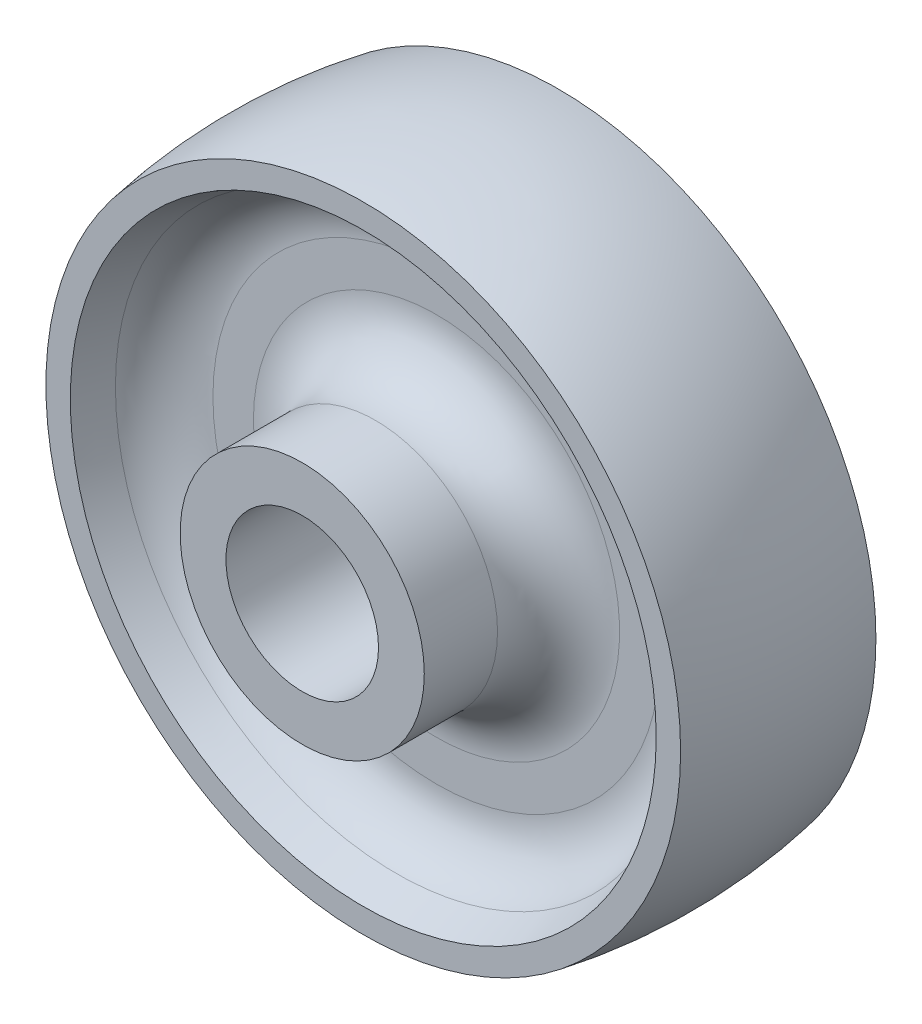
ISO-10303-21;
HEADER;
FILE_DESCRIPTION(('STEP AP214'),'2;1');
FILE_NAME('part.step','',(''),(''),'','','');
FILE_SCHEMA(('AUTOMOTIVE_DESIGN { 1 0 10303 214 1 1 1 1 }'));
ENDSEC;
DATA;
#1=APPLICATION_CONTEXT('core data for automotive mechanical design processes');
#2=APPLICATION_PROTOCOL_DEFINITION('international standard','automotive_design',2000,#1);
#3=PRODUCT_CONTEXT('',#1,'mechanical');
#4=PRODUCT('Part','Part','',(#3));
#5=PRODUCT_RELATED_PRODUCT_CATEGORY('part','',(#4));
#6=PRODUCT_DEFINITION_FORMATION('','',#4);
#7=PRODUCT_DEFINITION_CONTEXT('part definition',#1,'design');
#8=PRODUCT_DEFINITION('design','',#6,#7);
#9=PRODUCT_DEFINITION_SHAPE('','',#8);
#10=(LENGTH_UNIT() NAMED_UNIT(*) SI_UNIT(.MILLI.,.METRE.));
#11=(NAMED_UNIT(*) PLANE_ANGLE_UNIT() SI_UNIT($,.RADIAN.));
#12=(NAMED_UNIT(*) SI_UNIT($,.STERADIAN.) SOLID_ANGLE_UNIT());
#13=UNCERTAINTY_MEASURE_WITH_UNIT(LENGTH_MEASURE(1.E-05),#10,'distance_accuracy_value','');
#14=(GEOMETRIC_REPRESENTATION_CONTEXT(3) GLOBAL_UNCERTAINTY_ASSIGNED_CONTEXT((#13)) GLOBAL_UNIT_ASSIGNED_CONTEXT((#10,
#11,#12)) REPRESENTATION_CONTEXT('',''));
#15=CARTESIAN_POINT('',(0.,0.,0.));
#16=DIRECTION('',(0.,0.,1.));
#17=DIRECTION('',(1.,0.,0.));
#18=AXIS2_PLACEMENT_3D('',#15,#16,#17);
#19=CARTESIAN_POINT('',(0.,20.,-26.));
#20=DIRECTION('',(0.,0.,1.));
#21=DIRECTION('',(1.,0.,0.));
#22=AXIS2_PLACEMENT_3D('',#19,#20,#21);
#23=PLANE('',#22);
#24=CARTESIAN_POINT('',(0.,0.,-26.));
#25=DIRECTION('',(0.,0.,1.));
#26=DIRECTION('',(1.,0.,0.));
#27=AXIS2_PLACEMENT_3D('',#24,#25,#26);
#28=CIRCLE('',#27,20.);
#29=CARTESIAN_POINT('',(20.,0.,-26.));
#30=VERTEX_POINT('',#29);
#31=EDGE_CURVE('E108',#30,#30,#28,.T.);
#32=ORIENTED_EDGE('',*,*,#31,.F.);
#33=EDGE_LOOP('',(#32));
#34=FACE_BOUND('',#33,.T.);
#35=CARTESIAN_POINT('',(0.,0.,-26.));
#36=DIRECTION('',(0.,0.,1.));
#37=DIRECTION('',(1.,0.,0.));
#38=AXIS2_PLACEMENT_3D('',#35,#36,#37);
#39=CIRCLE('',#38,12.5);
#40=CARTESIAN_POINT('',(12.5,0.,-26.));
#41=VERTEX_POINT('',#40);
#42=EDGE_CURVE('E80',#41,#41,#39,.T.);
#43=ORIENTED_EDGE('',*,*,#42,.T.);
#44=EDGE_LOOP('',(#43));
#45=FACE_BOUND('',#44,.T.);
#46=ADVANCED_FACE('F40',(#34,#45),#23,.F.);
#47=CARTESIAN_POINT('',(0.,0.,0.));
#48=DIRECTION('',(0.,0.,1.));
#49=DIRECTION('',(1.,0.,0.));
#50=AXIS2_PLACEMENT_3D('',#47,#48,#49);
#51=CYLINDRICAL_SURFACE('',#50,12.5);
#52=ORIENTED_EDGE('',*,*,#42,.F.);
#53=EDGE_LOOP('',(#52));
#54=FACE_BOUND('',#53,.T.);
#55=CARTESIAN_POINT('',(0.,0.,26.));
#56=DIRECTION('',(0.,0.,1.));
#57=DIRECTION('',(1.,0.,0.));
#58=AXIS2_PLACEMENT_3D('',#55,#56,#57);
#59=CIRCLE('',#58,12.5);
#60=CARTESIAN_POINT('',(12.5,0.,26.));
#61=VERTEX_POINT('',#60);
#62=EDGE_CURVE('E84',#61,#61,#59,.T.);
#63=ORIENTED_EDGE('',*,*,#62,.T.);
#64=EDGE_LOOP('',(#63));
#65=FACE_BOUND('',#64,.T.);
#66=ADVANCED_FACE('F117',(#54,#65),#51,.F.);
#67=CARTESIAN_POINT('',(0.,12.5,26.));
#68=DIRECTION('',(0.,0.,-1.));
#69=DIRECTION('',(-1.,0.,0.));
#70=AXIS2_PLACEMENT_3D('',#67,#68,#69);
#71=PLANE('',#70);
#72=ORIENTED_EDGE('',*,*,#62,.F.);
#73=EDGE_LOOP('',(#72));
#74=FACE_BOUND('',#73,.T.);
#75=CARTESIAN_POINT('',(0.,0.,26.));
#76=DIRECTION('',(0.,0.,1.));
#77=DIRECTION('',(1.,0.,0.));
#78=AXIS2_PLACEMENT_3D('',#75,#76,#77);
#79=CIRCLE('',#78,20.);
#80=CARTESIAN_POINT('',(20.,0.,26.));
#81=VERTEX_POINT('',#80);
#82=EDGE_CURVE('E88',#81,#81,#79,.T.);
#83=ORIENTED_EDGE('',*,*,#82,.T.);
#84=EDGE_LOOP('',(#83));
#85=FACE_BOUND('',#84,.T.);
#86=ADVANCED_FACE('F123',(#74,#85),#71,.F.);
#87=CARTESIAN_POINT('',(0.,0.,0.));
#88=DIRECTION('',(0.,0.,1.));
#89=DIRECTION('',(1.,0.,0.));
#90=AXIS2_PLACEMENT_3D('',#87,#88,#89);
#91=CYLINDRICAL_SURFACE('',#90,20.);
#92=CARTESIAN_POINT('',(0.,0.,14.));
#93=DIRECTION('',(0.,0.,-1.));
#94=DIRECTION('',(-1.,0.,0.));
#95=AXIS2_PLACEMENT_3D('',#92,#93,#94);
#96=CIRCLE('',#95,20.);
#97=CARTESIAN_POINT('',(-20.,0.,14.));
#98=VERTEX_POINT('',#97);
#99=EDGE_CURVE('E10',#98,#98,#96,.F.);
#100=ORIENTED_EDGE('',*,*,#99,.T.);
#101=EDGE_LOOP('',(#100));
#102=FACE_BOUND('',#101,.T.);
#103=ORIENTED_EDGE('',*,*,#82,.F.);
#104=EDGE_LOOP('',(#103));
#105=FACE_BOUND('',#104,.T.);
#106=ADVANCED_FACE('F129',(#102,#105),#91,.T.);
#107=CARTESIAN_POINT('',(0.,20.,4.));
#108=DIRECTION('',(0.,0.,-1.));
#109=DIRECTION('',(-1.,0.,0.));
#110=AXIS2_PLACEMENT_3D('',#107,#108,#109);
#111=PLANE('',#110);
#112=CARTESIAN_POINT('',(0.,0.,4.));
#113=DIRECTION('',(0.,0.,-1.));
#114=DIRECTION('',(-1.,0.,0.));
#115=AXIS2_PLACEMENT_3D('',#112,#113,#114);
#116=CIRCLE('',#115,36.6302818067085);
#117=CARTESIAN_POINT('',(-36.6302818067085,0.,4.));
#118=VERTEX_POINT('',#117);
#119=EDGE_CURVE('E53',#118,#118,#116,.F.);
#120=ORIENTED_EDGE('',*,*,#119,.T.);
#121=EDGE_LOOP('',(#120));
#122=FACE_BOUND('',#121,.T.);
#123=CARTESIAN_POINT('',(0.,0.,4.));
#124=DIRECTION('',(0.,0.,-1.));
#125=DIRECTION('',(-1.,0.,0.));
#126=AXIS2_PLACEMENT_3D('',#123,#124,#125);
#127=CIRCLE('',#126,30.);
#128=CARTESIAN_POINT('',(-30.,0.,4.));
#129=VERTEX_POINT('',#128);
#130=EDGE_CURVE('E58',#129,#129,#127,.T.);
#131=ORIENTED_EDGE('',*,*,#130,.T.);
#132=EDGE_LOOP('',(#131));
#133=FACE_BOUND('',#132,.T.);
#134=ADVANCED_FACE('F134',(#122,#133),#111,.F.);
#135=CARTESIAN_POINT('',(0.,0.,16.));
#136=DIRECTION('',(0.,0.,1.));
#137=DIRECTION('',(1.,0.,0.));
#138=AXIS2_PLACEMENT_3D('',#135,#136,#137);
#139=CONICAL_SURFACE('',#138,48.,0.349065850398861);
#140=CARTESIAN_POINT('',(0.,0.,10.5797985667434));
#141=DIRECTION('',(0.,0.,1.));
#142=DIRECTION('',(1.,0.,0.));
#143=AXIS2_PLACEMENT_3D('',#140,#141,#142);
#144=CIRCLE('',#143,46.0272080145676);
#145=CARTESIAN_POINT('',(46.0272080145676,0.,10.5797985667434));
#146=VERTEX_POINT('',#145);
#147=EDGE_CURVE('E48',#146,#146,#144,.F.);
#148=ORIENTED_EDGE('',*,*,#147,.T.);
#149=EDGE_LOOP('',(#148));
#150=FACE_BOUND('',#149,.T.);
#151=CARTESIAN_POINT('',(0.,0.,16.));
#152=DIRECTION('',(0.,0.,1.));
#153=DIRECTION('',(1.,0.,0.));
#154=AXIS2_PLACEMENT_3D('',#151,#152,#153);
#155=CIRCLE('',#154,48.);
#156=CARTESIAN_POINT('',(48.,0.,16.));
#157=VERTEX_POINT('',#156);
#158=EDGE_CURVE('E92',#157,#157,#155,.T.);
#159=ORIENTED_EDGE('',*,*,#158,.T.);
#160=EDGE_LOOP('',(#159));
#161=FACE_BOUND('',#160,.T.);
#162=ADVANCED_FACE('F140',(#150,#161),#139,.F.);
#163=CARTESIAN_POINT('',(0.,48.,16.));
#164=DIRECTION('',(0.,0.,-1.));
#165=DIRECTION('',(-1.,0.,0.));
#166=AXIS2_PLACEMENT_3D('',#163,#164,#165);
#167=PLANE('',#166);
#168=ORIENTED_EDGE('',*,*,#158,.F.);
#169=EDGE_LOOP('',(#168));
#170=FACE_BOUND('',#169,.T.);
#171=CARTESIAN_POINT('',(0.,0.,16.));
#172=DIRECTION('',(0.,0.,1.));
#173=DIRECTION('',(1.,0.,0.));
#174=AXIS2_PLACEMENT_3D('',#171,#172,#173);
#175=CIRCLE('',#174,52.);
#176=CARTESIAN_POINT('',(52.,0.,16.));
#177=VERTEX_POINT('',#176);
#178=EDGE_CURVE('E96',#177,#177,#175,.T.);
#179=ORIENTED_EDGE('',*,*,#178,.T.);
#180=EDGE_LOOP('',(#179));
#181=FACE_BOUND('',#180,.T.);
#182=ADVANCED_FACE('F180',(#170,#181),#167,.F.);
#183=CARTESIAN_POINT('',(0.,0.,0.));
#184=DIRECTION('',(0.,0.,1.));
#185=DIRECTION('',(1.,0.,0.));
#186=AXIS2_PLACEMENT_3D('',#183,#184,#185);
#187=DEGENERATE_TOROIDAL_SURFACE('',#186,36.5663593019381,90.,.F.);
#188=ORIENTED_EDGE('',*,*,#178,.F.);
#189=EDGE_LOOP('',(#188));
#190=FACE_BOUND('',#189,.T.);
#191=CARTESIAN_POINT('',(0.,0.,-16.));
#192=DIRECTION('',(0.,0.,1.));
#193=DIRECTION('',(1.,0.,0.));
#194=AXIS2_PLACEMENT_3D('',#191,#192,#193);
#195=CIRCLE('',#194,52.);
#196=CARTESIAN_POINT('',(52.,0.,-16.));
#197=VERTEX_POINT('',#196);
#198=EDGE_CURVE('E100',#197,#197,#195,.T.);
#199=ORIENTED_EDGE('',*,*,#198,.T.);
#200=EDGE_LOOP('',(#199));
#201=FACE_BOUND('',#200,.T.);
#202=ADVANCED_FACE('F231',(#190,#201),#187,.F.);
#203=CARTESIAN_POINT('',(0.,52.,-16.));
#204=DIRECTION('',(0.,0.,1.));
#205=DIRECTION('',(1.,0.,0.));
#206=AXIS2_PLACEMENT_3D('',#203,#204,#205);
#207=PLANE('',#206);
#208=ORIENTED_EDGE('',*,*,#198,.F.);
#209=EDGE_LOOP('',(#208));
#210=FACE_BOUND('',#209,.T.);
#211=CARTESIAN_POINT('',(0.,0.,-16.));
#212=DIRECTION('',(0.,0.,1.));
#213=DIRECTION('',(1.,0.,0.));
#214=AXIS2_PLACEMENT_3D('',#211,#212,#213);
#215=CIRCLE('',#214,48.);
#216=CARTESIAN_POINT('',(48.,0.,-16.));
#217=VERTEX_POINT('',#216);
#218=EDGE_CURVE('E104',#217,#217,#215,.T.);
#219=ORIENTED_EDGE('',*,*,#218,.T.);
#220=EDGE_LOOP('',(#219));
#221=FACE_BOUND('',#220,.T.);
#222=ADVANCED_FACE('F240',(#210,#221),#207,.F.);
#223=CARTESIAN_POINT('',(0.,0.,-4.));
#224=DIRECTION('',(0.,0.,-1.));
#225=DIRECTION('',(-1.,0.,0.));
#226=AXIS2_PLACEMENT_3D('',#223,#224,#225);
#227=CONICAL_SURFACE('',#226,43.6323571888057,0.34906585039886);
#228=CARTESIAN_POINT('',(0.,0.,-10.5797985667434));
#229=DIRECTION('',(0.,0.,-1.));
#230=DIRECTION('',(-1.,0.,0.));
#231=AXIS2_PLACEMENT_3D('',#228,#229,#230);
#232=CIRCLE('',#231,46.0272080145676);
#233=CARTESIAN_POINT('',(-46.0272080145676,0.,-10.5797985667434));
#234=VERTEX_POINT('',#233);
#235=EDGE_CURVE('E76',#234,#234,#232,.F.);
#236=ORIENTED_EDGE('',*,*,#235,.T.);
#237=EDGE_LOOP('',(#236));
#238=FACE_BOUND('',#237,.T.);
#239=ORIENTED_EDGE('',*,*,#218,.F.);
#240=EDGE_LOOP('',(#239));
#241=FACE_BOUND('',#240,.T.);
#242=ADVANCED_FACE('F250',(#238,#241),#227,.F.);
#243=CARTESIAN_POINT('',(0.,43.6323571888057,-4.));
#244=DIRECTION('',(0.,0.,1.));
#245=DIRECTION('',(1.,0.,0.));
#246=AXIS2_PLACEMENT_3D('',#243,#244,#245);
#247=PLANE('',#246);
#248=CARTESIAN_POINT('',(0.,0.,-4.));
#249=DIRECTION('',(0.,0.,1.));
#250=DIRECTION('',(1.,0.,0.));
#251=AXIS2_PLACEMENT_3D('',#248,#249,#250);
#252=CIRCLE('',#251,36.6302818067085);
#253=CARTESIAN_POINT('',(36.6302818067085,0.,-4.));
#254=VERTEX_POINT('',#253);
#255=EDGE_CURVE('E68',#254,#254,#252,.F.);
#256=ORIENTED_EDGE('',*,*,#255,.T.);
#257=EDGE_LOOP('',(#256));
#258=FACE_BOUND('',#257,.T.);
#259=CARTESIAN_POINT('',(0.,0.,-4.));
#260=DIRECTION('',(0.,0.,1.));
#261=DIRECTION('',(1.,0.,0.));
#262=AXIS2_PLACEMENT_3D('',#259,#260,#261);
#263=CIRCLE('',#262,30.);
#264=CARTESIAN_POINT('',(30.,0.,-4.));
#265=VERTEX_POINT('',#264);
#266=EDGE_CURVE('E72',#265,#265,#263,.T.);
#267=ORIENTED_EDGE('',*,*,#266,.T.);
#268=EDGE_LOOP('',(#267));
#269=FACE_BOUND('',#268,.T.);
#270=ADVANCED_FACE('F260',(#258,#269),#247,.F.);
#271=CARTESIAN_POINT('',(0.,0.,0.));
#272=DIRECTION('',(0.,0.,1.));
#273=DIRECTION('',(1.,0.,0.));
#274=AXIS2_PLACEMENT_3D('',#271,#272,#273);
#275=CYLINDRICAL_SURFACE('',#274,20.);
#276=CARTESIAN_POINT('',(0.,0.,-14.));
#277=DIRECTION('',(0.,0.,1.));
#278=DIRECTION('',(1.,0.,0.));
#279=AXIS2_PLACEMENT_3D('',#276,#277,#278);
#280=CIRCLE('',#279,20.);
#281=CARTESIAN_POINT('',(20.,0.,-14.));
#282=VERTEX_POINT('',#281);
#283=EDGE_CURVE('E64',#282,#282,#280,.F.);
#284=ORIENTED_EDGE('',*,*,#283,.T.);
#285=EDGE_LOOP('',(#284));
#286=FACE_BOUND('',#285,.T.);
#287=ORIENTED_EDGE('',*,*,#31,.T.);
#288=EDGE_LOOP('',(#287));
#289=FACE_BOUND('',#288,.T.);
#290=ADVANCED_FACE('F113',(#286,#289),#275,.T.);
#291=CARTESIAN_POINT('',(0.,0.,-14.));
#292=DIRECTION('',(0.,0.,1.));
#293=DIRECTION('',(1.,0.,0.));
#294=AXIS2_PLACEMENT_3D('',#291,#292,#293);
#295=TOROIDAL_SURFACE('',#294,36.6302818067085,10.);
#296=ORIENTED_EDGE('',*,*,#255,.F.);
#297=EDGE_LOOP('',(#296));
#298=FACE_BOUND('',#297,.T.);
#299=ORIENTED_EDGE('',*,*,#235,.F.);
#300=EDGE_LOOP('',(#299));
#301=FACE_BOUND('',#300,.T.);
#302=ADVANCED_FACE('F145',(#298,#301),#295,.F.);
#303=CARTESIAN_POINT('',(0.,0.,-14.));
#304=DIRECTION('',(0.,0.,1.));
#305=DIRECTION('',(1.,0.,0.));
#306=AXIS2_PLACEMENT_3D('',#303,#304,#305);
#307=TOROIDAL_SURFACE('',#306,30.,10.);
#308=ORIENTED_EDGE('',*,*,#283,.F.);
#309=EDGE_LOOP('',(#308));
#310=FACE_BOUND('',#309,.T.);
#311=ORIENTED_EDGE('',*,*,#266,.F.);
#312=EDGE_LOOP('',(#311));
#313=FACE_BOUND('',#312,.T.);
#314=ADVANCED_FACE('F148',(#310,#313),#307,.F.);
#315=CARTESIAN_POINT('',(0.,0.,14.));
#316=DIRECTION('',(0.,0.,-1.));
#317=DIRECTION('',(-1.,0.,0.));
#318=AXIS2_PLACEMENT_3D('',#315,#316,#317);
#319=TOROIDAL_SURFACE('',#318,36.6302818067085,10.);
#320=ORIENTED_EDGE('',*,*,#147,.F.);
#321=EDGE_LOOP('',(#320));
#322=FACE_BOUND('',#321,.T.);
#323=ORIENTED_EDGE('',*,*,#119,.F.);
#324=EDGE_LOOP('',(#323));
#325=FACE_BOUND('',#324,.T.);
#326=ADVANCED_FACE('F151',(#322,#325),#319,.F.);
#327=CARTESIAN_POINT('',(0.,0.,14.));
#328=DIRECTION('',(0.,0.,-1.));
#329=DIRECTION('',(-1.,0.,0.));
#330=AXIS2_PLACEMENT_3D('',#327,#328,#329);
#331=TOROIDAL_SURFACE('',#330,30.,10.);
#332=ORIENTED_EDGE('',*,*,#130,.F.);
#333=EDGE_LOOP('',(#332));
#334=FACE_BOUND('',#333,.T.);
#335=ORIENTED_EDGE('',*,*,#99,.F.);
#336=EDGE_LOOP('',(#335));
#337=FACE_BOUND('',#336,.T.);
#338=ADVANCED_FACE('F42',(#334,#337),#331,.F.);
#339=CLOSED_SHELL('',(#46,#66,#86,#106,#134,#162,#182,#202,#222,#242,#270,#290,#302,#314,#326,#338));
#340=MANIFOLD_SOLID_BREP('B2',#339);
#341=ADVANCED_BREP_SHAPE_REPRESENTATION('',(#18,#340),#14);
#342=SHAPE_DEFINITION_REPRESENTATION(#9,#341);
ENDSEC;
END-ISO-10303-21;
